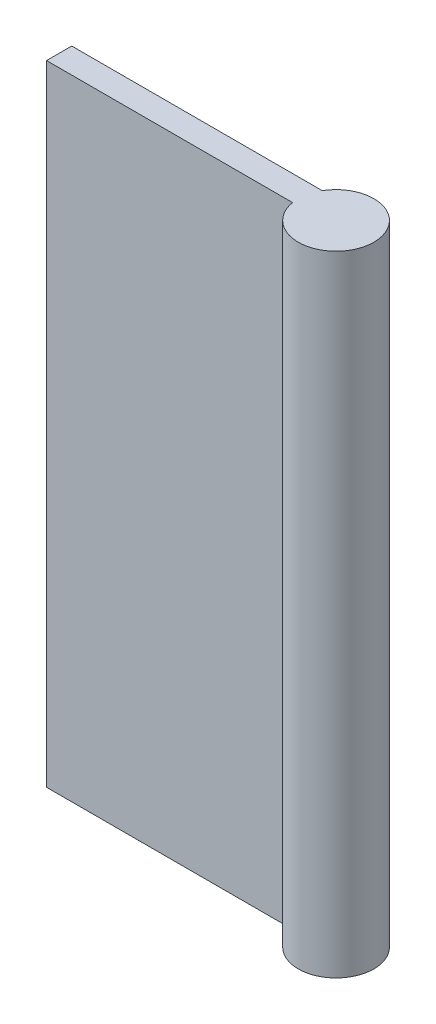
ISO-10303-21;
HEADER;
FILE_DESCRIPTION(('STEP AP214'),'2;1');
FILE_NAME('part.step','',(''),(''),'','','');
FILE_SCHEMA(('AUTOMOTIVE_DESIGN { 1 0 10303 214 1 1 1 1 }'));
ENDSEC;
DATA;
#1=APPLICATION_CONTEXT('core data for automotive mechanical design processes');
#2=APPLICATION_PROTOCOL_DEFINITION('international standard','automotive_design',2000,#1);
#3=PRODUCT_CONTEXT('',#1,'mechanical');
#4=PRODUCT('Part','Part','',(#3));
#5=PRODUCT_RELATED_PRODUCT_CATEGORY('part','',(#4));
#6=PRODUCT_DEFINITION_FORMATION('','',#4);
#7=PRODUCT_DEFINITION_CONTEXT('part definition',#1,'design');
#8=PRODUCT_DEFINITION('design','',#6,#7);
#9=PRODUCT_DEFINITION_SHAPE('','',#8);
#10=(LENGTH_UNIT() NAMED_UNIT(*) SI_UNIT(.MILLI.,.METRE.));
#11=(NAMED_UNIT(*) PLANE_ANGLE_UNIT() SI_UNIT($,.RADIAN.));
#12=(NAMED_UNIT(*) SI_UNIT($,.STERADIAN.) SOLID_ANGLE_UNIT());
#13=UNCERTAINTY_MEASURE_WITH_UNIT(LENGTH_MEASURE(1.E-05),#10,'distance_accuracy_value','');
#14=(GEOMETRIC_REPRESENTATION_CONTEXT(3) GLOBAL_UNCERTAINTY_ASSIGNED_CONTEXT((#13)) GLOBAL_UNIT_ASSIGNED_CONTEXT((#10,
#11,#12)) REPRESENTATION_CONTEXT('',''));
#15=CARTESIAN_POINT('',(0.,0.,0.));
#16=DIRECTION('',(0.,0.,1.));
#17=DIRECTION('',(1.,0.,0.));
#18=AXIS2_PLACEMENT_3D('',#15,#16,#17);
#19=CARTESIAN_POINT('',(-10.,25.,2.));
#20=DIRECTION('',(0.,-1.,0.));
#21=DIRECTION('',(0.,0.,-1.));
#22=AXIS2_PLACEMENT_3D('',#19,#20,#21);
#23=PLANE('',#22);
#24=DIRECTION('',(-1.,0.,0.));
#25=VECTOR('',#24,1.);
#26=CARTESIAN_POINT('',(-10.,25.,2.));
#27=LINE('',#26,#25);
#28=CARTESIAN_POINT('',(9.54196010845019,25.,2.));
#29=VERTEX_POINT('',#28);
#30=CARTESIAN_POINT('',(-10.,25.,2.));
#31=VERTEX_POINT('',#30);
#32=EDGE_CURVE('E89',#29,#31,#27,.T.);
#33=ORIENTED_EDGE('',*,*,#32,.F.);
#34=CARTESIAN_POINT('',(12.5,25.,1.5));
#35=DIRECTION('',(0.,1.,0.));
#36=DIRECTION('',(0.,0.,1.));
#37=AXIS2_PLACEMENT_3D('',#34,#35,#36);
#38=CIRCLE('',#37,3.);
#39=CARTESIAN_POINT('',(9.90192378864668,25.,0.));
#40=VERTEX_POINT('',#39);
#41=EDGE_CURVE('E48',#29,#40,#38,.T.);
#42=ORIENTED_EDGE('',*,*,#41,.T.);
#43=DIRECTION('',(-1.,0.,0.));
#44=VECTOR('',#43,1.);
#45=CARTESIAN_POINT('',(-10.,25.,0.));
#46=LINE('',#45,#44);
#47=CARTESIAN_POINT('',(-10.,25.,0.));
#48=VERTEX_POINT('',#47);
#49=EDGE_CURVE('E78',#40,#48,#46,.T.);
#50=ORIENTED_EDGE('',*,*,#49,.T.);
#51=DIRECTION('',(0.,0.,-1.));
#52=VECTOR('',#51,1.);
#53=CARTESIAN_POINT('',(-10.,25.,2.));
#54=LINE('',#53,#52);
#55=EDGE_CURVE('E41',#31,#48,#54,.T.);
#56=ORIENTED_EDGE('',*,*,#55,.F.);
#57=EDGE_LOOP('',(#33,#42,#50,#56));
#58=FACE_BOUND('',#57,.T.);
#59=ADVANCED_FACE('F34',(#58),#23,.F.);
#60=CARTESIAN_POINT('',(-10.,-25.,2.));
#61=DIRECTION('',(1.,0.,0.));
#62=DIRECTION('',(0.,0.,-1.));
#63=AXIS2_PLACEMENT_3D('',#60,#61,#62);
#64=PLANE('',#63);
#65=DIRECTION('',(0.,-1.,0.));
#66=VECTOR('',#65,1.);
#67=CARTESIAN_POINT('',(-10.,-25.,0.));
#68=LINE('',#67,#66);
#69=CARTESIAN_POINT('',(-10.,-25.,0.));
#70=VERTEX_POINT('',#69);
#71=EDGE_CURVE('E68',#48,#70,#68,.T.);
#72=ORIENTED_EDGE('',*,*,#71,.T.);
#73=DIRECTION('',(0.,0.,-1.));
#74=VECTOR('',#73,1.);
#75=CARTESIAN_POINT('',(-10.,-25.,2.));
#76=LINE('',#75,#74);
#77=CARTESIAN_POINT('',(-10.,-25.,2.));
#78=VERTEX_POINT('',#77);
#79=EDGE_CURVE('E71',#78,#70,#76,.T.);
#80=ORIENTED_EDGE('',*,*,#79,.F.);
#81=DIRECTION('',(0.,-1.,0.));
#82=VECTOR('',#81,1.);
#83=CARTESIAN_POINT('',(-10.,-25.,2.));
#84=LINE('',#83,#82);
#85=EDGE_CURVE('E56',#31,#78,#84,.T.);
#86=ORIENTED_EDGE('',*,*,#85,.F.);
#87=ORIENTED_EDGE('',*,*,#55,.T.);
#88=EDGE_LOOP('',(#72,#80,#86,#87));
#89=FACE_BOUND('',#88,.T.);
#90=ADVANCED_FACE('F70',(#89),#64,.F.);
#91=CARTESIAN_POINT('',(-10.,-25.,2.));
#92=DIRECTION('',(0.,1.,0.));
#93=DIRECTION('',(0.,0.,1.));
#94=AXIS2_PLACEMENT_3D('',#91,#92,#93);
#95=PLANE('',#94);
#96=DIRECTION('',(1.,0.,0.));
#97=VECTOR('',#96,1.);
#98=CARTESIAN_POINT('',(-10.,-25.,0.));
#99=LINE('',#98,#97);
#100=CARTESIAN_POINT('',(9.90192378864668,-25.,0.));
#101=VERTEX_POINT('',#100);
#102=EDGE_CURVE('E77',#70,#101,#99,.T.);
#103=ORIENTED_EDGE('',*,*,#102,.T.);
#104=CARTESIAN_POINT('',(12.5,-25.,1.5));
#105=DIRECTION('',(0.,1.,0.));
#106=DIRECTION('',(0.,0.,1.));
#107=AXIS2_PLACEMENT_3D('',#104,#105,#106);
#108=CIRCLE('',#107,3.);
#109=CARTESIAN_POINT('',(9.54196010845019,-25.,2.));
#110=VERTEX_POINT('',#109);
#111=EDGE_CURVE('E99',#110,#101,#108,.T.);
#112=ORIENTED_EDGE('',*,*,#111,.F.);
#113=DIRECTION('',(1.,0.,0.));
#114=VECTOR('',#113,1.);
#115=CARTESIAN_POINT('',(-10.,-25.,2.));
#116=LINE('',#115,#114);
#117=EDGE_CURVE('E85',#78,#110,#116,.T.);
#118=ORIENTED_EDGE('',*,*,#117,.F.);
#119=ORIENTED_EDGE('',*,*,#79,.T.);
#120=EDGE_LOOP('',(#103,#112,#118,#119));
#121=FACE_BOUND('',#120,.T.);
#122=ADVANCED_FACE('F82',(#121),#95,.F.);
#123=CARTESIAN_POINT('',(0.,0.,2.));
#124=DIRECTION('',(0.,0.,-1.));
#125=DIRECTION('',(-1.,0.,0.));
#126=AXIS2_PLACEMENT_3D('',#123,#124,#125);
#127=PLANE('',#126);
#128=ORIENTED_EDGE('',*,*,#117,.T.);
#129=DIRECTION('',(0.,1.,0.));
#130=VECTOR('',#129,1.);
#131=CARTESIAN_POINT('',(9.54196010845019,-25.,2.));
#132=LINE('',#131,#130);
#133=EDGE_CURVE('E94',#110,#29,#132,.T.);
#134=ORIENTED_EDGE('',*,*,#133,.T.);
#135=ORIENTED_EDGE('',*,*,#32,.T.);
#136=ORIENTED_EDGE('',*,*,#85,.T.);
#137=EDGE_LOOP('',(#128,#134,#135,#136));
#138=FACE_BOUND('',#137,.T.);
#139=ADVANCED_FACE('F107',(#138),#127,.F.);
#140=CARTESIAN_POINT('',(0.,0.,0.));
#141=DIRECTION('',(0.,0.,-1.));
#142=DIRECTION('',(-1.,0.,0.));
#143=AXIS2_PLACEMENT_3D('',#140,#141,#142);
#144=PLANE('',#143);
#145=DIRECTION('',(0.,1.,0.));
#146=VECTOR('',#145,1.);
#147=CARTESIAN_POINT('',(9.90192378864668,-25.,0.));
#148=LINE('',#147,#146);
#149=EDGE_CURVE('E11',#101,#40,#148,.T.);
#150=ORIENTED_EDGE('',*,*,#149,.F.);
#151=ORIENTED_EDGE('',*,*,#102,.F.);
#152=ORIENTED_EDGE('',*,*,#71,.F.);
#153=ORIENTED_EDGE('',*,*,#49,.F.);
#154=EDGE_LOOP('',(#150,#151,#152,#153));
#155=FACE_BOUND('',#154,.T.);
#156=ADVANCED_FACE('F88',(#155),#144,.T.);
#157=CARTESIAN_POINT('',(12.5,-25.,1.5));
#158=DIRECTION('',(0.,1.,0.));
#159=DIRECTION('',(0.,0.,1.));
#160=AXIS2_PLACEMENT_3D('',#157,#158,#159);
#161=CYLINDRICAL_SURFACE('',#160,3.);
#162=ORIENTED_EDGE('',*,*,#133,.F.);
#163=ORIENTED_EDGE('',*,*,#111,.T.);
#164=ORIENTED_EDGE('',*,*,#149,.T.);
#165=ORIENTED_EDGE('',*,*,#41,.F.);
#166=EDGE_LOOP('',(#162,#163,#164,#165));
#167=FACE_BOUND('',#166,.T.);
#168=ADVANCED_FACE('F104',(#167),#161,.T.);
#169=CLOSED_SHELL('',(#59,#90,#122,#139,#156,#168));
#170=MANIFOLD_SOLID_BREP('B2',#169);
#171=ADVANCED_BREP_SHAPE_REPRESENTATION('',(#18,#170),#14);
#172=SHAPE_DEFINITION_REPRESENTATION(#9,#171);
ENDSEC;
END-ISO-10303-21;
